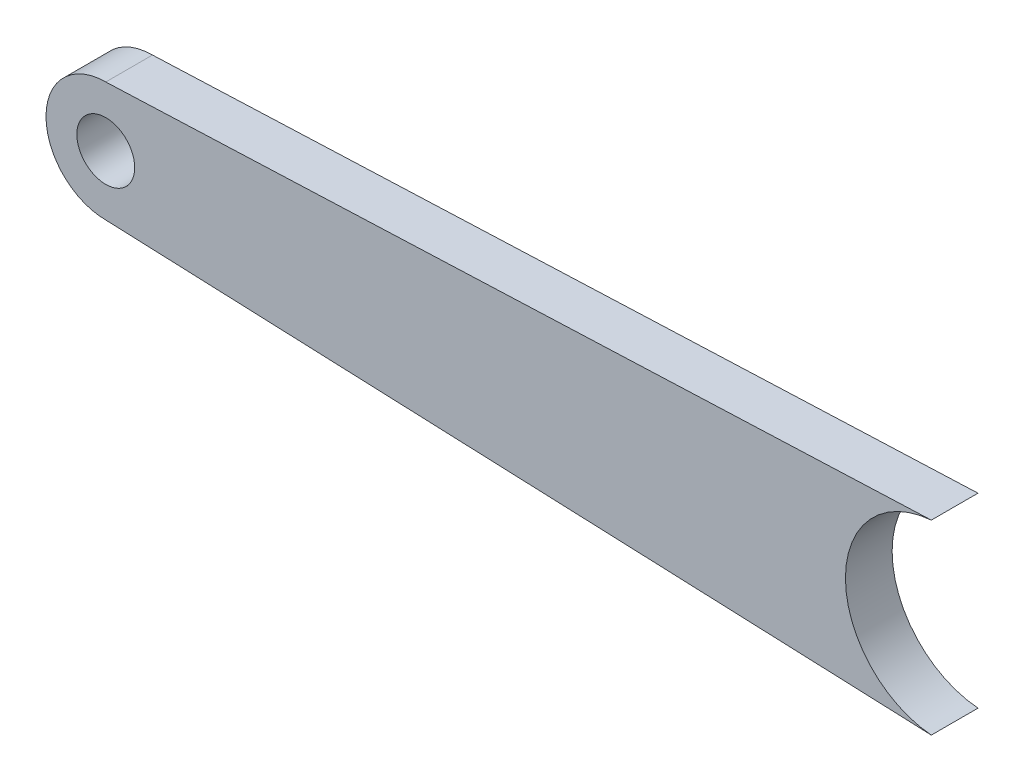
ISO-10303-21;
HEADER;
FILE_DESCRIPTION(('STEP AP214'),'2;1');
FILE_NAME('part.step','',(''),(''),'','','');
FILE_SCHEMA(('AUTOMOTIVE_DESIGN { 1 0 10303 214 1 1 1 1 }'));
ENDSEC;
DATA;
#1=APPLICATION_CONTEXT('core data for automotive mechanical design processes');
#2=APPLICATION_PROTOCOL_DEFINITION('international standard','automotive_design',2000,#1);
#3=PRODUCT_CONTEXT('',#1,'mechanical');
#4=PRODUCT('Part','Part','',(#3));
#5=PRODUCT_RELATED_PRODUCT_CATEGORY('part','',(#4));
#6=PRODUCT_DEFINITION_FORMATION('','',#4);
#7=PRODUCT_DEFINITION_CONTEXT('part definition',#1,'design');
#8=PRODUCT_DEFINITION('design','',#6,#7);
#9=PRODUCT_DEFINITION_SHAPE('','',#8);
#10=(LENGTH_UNIT() NAMED_UNIT(*) SI_UNIT(.MILLI.,.METRE.));
#11=(NAMED_UNIT(*) PLANE_ANGLE_UNIT() SI_UNIT($,.RADIAN.));
#12=(NAMED_UNIT(*) SI_UNIT($,.STERADIAN.) SOLID_ANGLE_UNIT());
#13=UNCERTAINTY_MEASURE_WITH_UNIT(LENGTH_MEASURE(1.E-05),#10,'distance_accuracy_value','');
#14=(GEOMETRIC_REPRESENTATION_CONTEXT(3) GLOBAL_UNCERTAINTY_ASSIGNED_CONTEXT((#13)) GLOBAL_UNIT_ASSIGNED_CONTEXT((#10,
#11,#12)) REPRESENTATION_CONTEXT('',''));
#15=CARTESIAN_POINT('',(0.,0.,0.));
#16=DIRECTION('',(0.,0.,1.));
#17=DIRECTION('',(1.,0.,0.));
#18=AXIS2_PLACEMENT_3D('',#15,#16,#17);
#19=CARTESIAN_POINT('',(0.,0.,6.35));
#20=DIRECTION('',(0.,0.,1.));
#21=DIRECTION('',(1.,0.,0.));
#22=AXIS2_PLACEMENT_3D('',#19,#20,#21);
#23=PLANE('',#22);
#24=CARTESIAN_POINT('',(0.,0.,6.35));
#25=DIRECTION('',(0.,0.,1.));
#26=DIRECTION('',(1.,0.,0.));
#27=AXIS2_PLACEMENT_3D('',#24,#25,#26);
#28=CIRCLE('',#27,8.128);
#29=CARTESIAN_POINT('',(0.,8.128,6.35));
#30=VERTEX_POINT('',#29);
#31=CARTESIAN_POINT('',(0.,-8.128,6.35));
#32=VERTEX_POINT('',#31);
#33=EDGE_CURVE('E11',#30,#32,#28,.T.);
#34=ORIENTED_EDGE('',*,*,#33,.T.);
#35=DIRECTION('',(0.999186579432474,-0.0403259157618487,0.));
#36=VECTOR('',#35,1.);
#37=CARTESIAN_POINT('',(-0.327502429231078,-8.11478241317005,6.35));
#38=LINE('',#37,#36);
#39=CARTESIAN_POINT('',(112.260554908652,-12.6586950411564,6.35));
#40=VERTEX_POINT('',#39);
#41=EDGE_CURVE('E112',#32,#40,#38,.T.);
#42=ORIENTED_EDGE('',*,*,#41,.T.);
#43=CARTESIAN_POINT('',(113.284,0.,6.35));
#44=DIRECTION('',(0.,0.,1.));
#45=DIRECTION('',(1.,0.,0.));
#46=AXIS2_PLACEMENT_3D('',#43,#44,#45);
#47=CIRCLE('',#46,12.7);
#48=CARTESIAN_POINT('',(112.260554908652,12.6586950411564,6.35));
#49=VERTEX_POINT('',#48);
#50=EDGE_CURVE('E116',#49,#40,#47,.T.);
#51=ORIENTED_EDGE('',*,*,#50,.F.);
#52=DIRECTION('',(0.999186579432474,0.0403259157618487,0.));
#53=VECTOR('',#52,1.);
#54=CARTESIAN_POINT('',(-0.327502429231078,8.11478241317005,6.35));
#55=LINE('',#54,#53);
#56=EDGE_CURVE('E52',#30,#49,#55,.T.);
#57=ORIENTED_EDGE('',*,*,#56,.F.);
#58=EDGE_LOOP('',(#34,#42,#51,#57));
#59=FACE_BOUND('',#58,.T.);
#60=CARTESIAN_POINT('',(0.,0.,6.35));
#61=DIRECTION('',(0.,0.,1.));
#62=DIRECTION('',(1.,0.,0.));
#63=AXIS2_PLACEMENT_3D('',#60,#61,#62);
#64=CIRCLE('',#63,3.937);
#65=CARTESIAN_POINT('',(3.937,0.,6.35));
#66=VERTEX_POINT('',#65);
#67=EDGE_CURVE('E100',#66,#66,#64,.T.);
#68=ORIENTED_EDGE('',*,*,#67,.F.);
#69=EDGE_LOOP('',(#68));
#70=FACE_BOUND('',#69,.T.);
#71=ADVANCED_FACE('F38',(#59,#70),#23,.T.);
#72=CARTESIAN_POINT('',(0.,0.,0.));
#73=DIRECTION('',(0.,0.,1.));
#74=DIRECTION('',(1.,0.,0.));
#75=AXIS2_PLACEMENT_3D('',#72,#73,#74);
#76=PLANE('',#75);
#77=CARTESIAN_POINT('',(0.,0.,0.));
#78=DIRECTION('',(0.,0.,1.));
#79=DIRECTION('',(1.,0.,0.));
#80=AXIS2_PLACEMENT_3D('',#77,#78,#79);
#81=CIRCLE('',#80,8.128);
#82=CARTESIAN_POINT('',(0.,8.128,0.));
#83=VERTEX_POINT('',#82);
#84=CARTESIAN_POINT('',(0.,-8.128,0.));
#85=VERTEX_POINT('',#84);
#86=EDGE_CURVE('E42',#83,#85,#81,.T.);
#87=ORIENTED_EDGE('',*,*,#86,.F.);
#88=DIRECTION('',(0.999186579432474,0.0403259157618487,0.));
#89=VECTOR('',#88,1.);
#90=CARTESIAN_POINT('',(-0.327502429231078,8.11478241317005,0.));
#91=LINE('',#90,#89);
#92=CARTESIAN_POINT('',(112.260554908652,12.6586950411564,0.));
#93=VERTEX_POINT('',#92);
#94=EDGE_CURVE('E82',#83,#93,#91,.T.);
#95=ORIENTED_EDGE('',*,*,#94,.T.);
#96=CARTESIAN_POINT('',(113.284,0.,0.));
#97=DIRECTION('',(0.,0.,1.));
#98=DIRECTION('',(1.,0.,0.));
#99=AXIS2_PLACEMENT_3D('',#96,#97,#98);
#100=CIRCLE('',#99,12.7);
#101=CARTESIAN_POINT('',(112.260554908652,-12.6586950411564,0.));
#102=VERTEX_POINT('',#101);
#103=EDGE_CURVE('E61',#93,#102,#100,.T.);
#104=ORIENTED_EDGE('',*,*,#103,.T.);
#105=DIRECTION('',(0.999186579432474,-0.0403259157618487,0.));
#106=VECTOR('',#105,1.);
#107=CARTESIAN_POINT('',(-0.327502429231078,-8.11478241317005,0.));
#108=LINE('',#107,#106);
#109=EDGE_CURVE('E91',#85,#102,#108,.T.);
#110=ORIENTED_EDGE('',*,*,#109,.F.);
#111=EDGE_LOOP('',(#87,#95,#104,#110));
#112=FACE_BOUND('',#111,.T.);
#113=CARTESIAN_POINT('',(0.,0.,0.));
#114=DIRECTION('',(0.,0.,1.));
#115=DIRECTION('',(1.,0.,0.));
#116=AXIS2_PLACEMENT_3D('',#113,#114,#115);
#117=CIRCLE('',#116,3.937);
#118=CARTESIAN_POINT('',(3.937,0.,0.));
#119=VERTEX_POINT('',#118);
#120=EDGE_CURVE('E102',#119,#119,#117,.T.);
#121=ORIENTED_EDGE('',*,*,#120,.T.);
#122=EDGE_LOOP('',(#121));
#123=FACE_BOUND('',#122,.T.);
#124=ADVANCED_FACE('F98',(#112,#123),#76,.F.);
#125=CARTESIAN_POINT('',(0.,0.,6.35));
#126=DIRECTION('',(0.,0.,-1.));
#127=DIRECTION('',(-1.,0.,0.));
#128=AXIS2_PLACEMENT_3D('',#125,#126,#127);
#129=CYLINDRICAL_SURFACE('',#128,8.128);
#130=ORIENTED_EDGE('',*,*,#86,.T.);
#131=DIRECTION('',(0.,0.,1.));
#132=VECTOR('',#131,1.);
#133=CARTESIAN_POINT('',(0.,-8.128,0.));
#134=LINE('',#133,#132);
#135=EDGE_CURVE('E96',#85,#32,#134,.T.);
#136=ORIENTED_EDGE('',*,*,#135,.T.);
#137=ORIENTED_EDGE('',*,*,#33,.F.);
#138=DIRECTION('',(0.,0.,1.));
#139=VECTOR('',#138,1.);
#140=CARTESIAN_POINT('',(0.,8.128,0.));
#141=LINE('',#140,#139);
#142=EDGE_CURVE('E87',#83,#30,#141,.T.);
#143=ORIENTED_EDGE('',*,*,#142,.F.);
#144=EDGE_LOOP('',(#130,#136,#137,#143));
#145=FACE_BOUND('',#144,.T.);
#146=ADVANCED_FACE('F40',(#145),#129,.T.);
#147=CARTESIAN_POINT('',(0.,0.,6.35));
#148=DIRECTION('',(0.,0.,-1.));
#149=DIRECTION('',(-1.,0.,0.));
#150=AXIS2_PLACEMENT_3D('',#147,#148,#149);
#151=CYLINDRICAL_SURFACE('',#150,3.937);
#152=ORIENTED_EDGE('',*,*,#67,.T.);
#153=EDGE_LOOP('',(#152));
#154=FACE_BOUND('',#153,.T.);
#155=ORIENTED_EDGE('',*,*,#120,.F.);
#156=EDGE_LOOP('',(#155));
#157=FACE_BOUND('',#156,.T.);
#158=ADVANCED_FACE('F124',(#154,#157),#151,.F.);
#159=CARTESIAN_POINT('',(113.284,0.,0.));
#160=DIRECTION('',(0.,0.,1.));
#161=DIRECTION('',(1.,0.,0.));
#162=AXIS2_PLACEMENT_3D('',#159,#160,#161);
#163=CYLINDRICAL_SURFACE('',#162,12.7);
#164=ORIENTED_EDGE('',*,*,#50,.T.);
#165=DIRECTION('',(0.,0.,1.));
#166=VECTOR('',#165,1.);
#167=CARTESIAN_POINT('',(112.260554908652,-12.6586950411564,0.));
#168=LINE('',#167,#166);
#169=EDGE_CURVE('E77',#102,#40,#168,.T.);
#170=ORIENTED_EDGE('',*,*,#169,.F.);
#171=ORIENTED_EDGE('',*,*,#103,.F.);
#172=DIRECTION('',(0.,0.,1.));
#173=VECTOR('',#172,1.);
#174=CARTESIAN_POINT('',(112.260554908652,12.6586950411564,0.));
#175=LINE('',#174,#173);
#176=EDGE_CURVE('E90',#93,#49,#175,.T.);
#177=ORIENTED_EDGE('',*,*,#176,.T.);
#178=EDGE_LOOP('',(#164,#170,#171,#177));
#179=FACE_BOUND('',#178,.T.);
#180=ADVANCED_FACE('F122',(#179),#163,.F.);
#181=CARTESIAN_POINT('',(-0.327502429231078,-8.11478241317005,0.));
#182=DIRECTION('',(-0.0403259157618487,-0.999186579432474,0.));
#183=DIRECTION('',(0.999186579432474,-0.0403259157618487,0.));
#184=AXIS2_PLACEMENT_3D('',#181,#182,#183);
#185=PLANE('',#184);
#186=ORIENTED_EDGE('',*,*,#41,.F.);
#187=ORIENTED_EDGE('',*,*,#135,.F.);
#188=ORIENTED_EDGE('',*,*,#109,.T.);
#189=ORIENTED_EDGE('',*,*,#169,.T.);
#190=EDGE_LOOP('',(#186,#187,#188,#189));
#191=FACE_BOUND('',#190,.T.);
#192=ADVANCED_FACE('F119',(#191),#185,.T.);
#193=CARTESIAN_POINT('',(-0.327502429231078,8.11478241317005,0.));
#194=DIRECTION('',(0.0403259157618487,-0.999186579432474,0.));
#195=DIRECTION('',(0.999186579432474,0.0403259157618487,0.));
#196=AXIS2_PLACEMENT_3D('',#193,#194,#195);
#197=PLANE('',#196);
#198=ORIENTED_EDGE('',*,*,#56,.T.);
#199=ORIENTED_EDGE('',*,*,#176,.F.);
#200=ORIENTED_EDGE('',*,*,#94,.F.);
#201=ORIENTED_EDGE('',*,*,#142,.T.);
#202=EDGE_LOOP('',(#198,#199,#200,#201));
#203=FACE_BOUND('',#202,.T.);
#204=ADVANCED_FACE('F86',(#203),#197,.F.);
#205=CLOSED_SHELL('',(#71,#124,#146,#158,#180,#192,#204));
#206=MANIFOLD_SOLID_BREP('B2',#205);
#207=ADVANCED_BREP_SHAPE_REPRESENTATION('',(#18,#206),#14);
#208=SHAPE_DEFINITION_REPRESENTATION(#9,#207);
ENDSEC;
END-ISO-10303-21;
